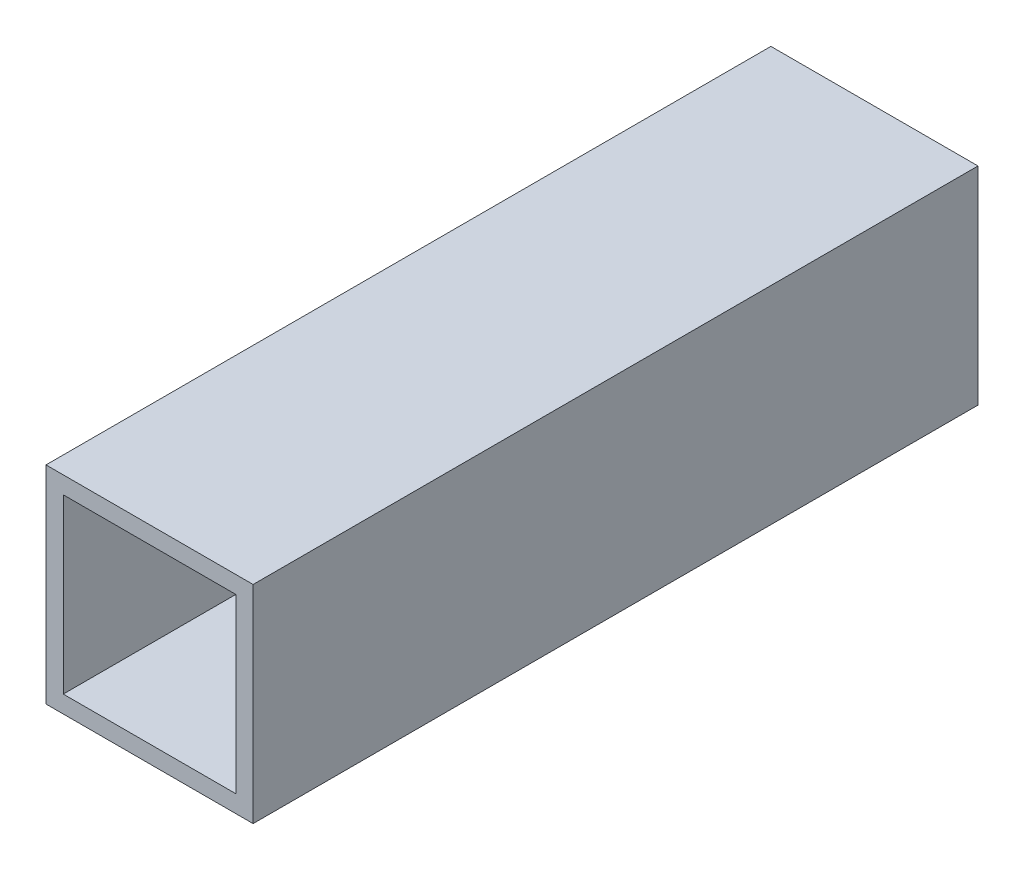
ISO-10303-21;
HEADER;
FILE_DESCRIPTION(('STEP AP214'),'2;1');
FILE_NAME('part.step','',(''),(''),'','','');
FILE_SCHEMA(('AUTOMOTIVE_DESIGN { 1 0 10303 214 1 1 1 1 }'));
ENDSEC;
DATA;
#1=APPLICATION_CONTEXT('core data for automotive mechanical design processes');
#2=APPLICATION_PROTOCOL_DEFINITION('international standard','automotive_design',2000,#1);
#3=PRODUCT_CONTEXT('',#1,'mechanical');
#4=PRODUCT('Part','Part','',(#3));
#5=PRODUCT_RELATED_PRODUCT_CATEGORY('part','',(#4));
#6=PRODUCT_DEFINITION_FORMATION('','',#4);
#7=PRODUCT_DEFINITION_CONTEXT('part definition',#1,'design');
#8=PRODUCT_DEFINITION('design','',#6,#7);
#9=PRODUCT_DEFINITION_SHAPE('','',#8);
#10=(LENGTH_UNIT() NAMED_UNIT(*) SI_UNIT(.MILLI.,.METRE.));
#11=(NAMED_UNIT(*) PLANE_ANGLE_UNIT() SI_UNIT($,.RADIAN.));
#12=(NAMED_UNIT(*) SI_UNIT($,.STERADIAN.) SOLID_ANGLE_UNIT());
#13=UNCERTAINTY_MEASURE_WITH_UNIT(LENGTH_MEASURE(1.E-05),#10,'distance_accuracy_value','');
#14=(GEOMETRIC_REPRESENTATION_CONTEXT(3) GLOBAL_UNCERTAINTY_ASSIGNED_CONTEXT((#13)) GLOBAL_UNIT_ASSIGNED_CONTEXT((#10,
#11,#12)) REPRESENTATION_CONTEXT('',''));
#15=CARTESIAN_POINT('',(0.,0.,0.));
#16=DIRECTION('',(0.,0.,1.));
#17=DIRECTION('',(1.,0.,0.));
#18=AXIS2_PLACEMENT_3D('',#15,#16,#17);
#19=CARTESIAN_POINT('',(-19.05,19.05,-66.675));
#20=DIRECTION('',(1.,0.,0.));
#21=DIRECTION('',(0.,0.,-1.));
#22=AXIS2_PLACEMENT_3D('',#19,#20,#21);
#23=PLANE('',#22);
#24=DIRECTION('',(0.,0.,1.));
#25=VECTOR('',#24,1.);
#26=CARTESIAN_POINT('',(-19.05,-19.05,-66.675));
#27=LINE('',#26,#25);
#28=CARTESIAN_POINT('',(-19.05,-19.05,-66.675));
#29=VERTEX_POINT('',#28);
#30=CARTESIAN_POINT('',(-19.05,-19.05,66.675));
#31=VERTEX_POINT('',#30);
#32=EDGE_CURVE('E129',#29,#31,#27,.T.);
#33=ORIENTED_EDGE('',*,*,#32,.T.);
#34=DIRECTION('',(0.,-1.,0.));
#35=VECTOR('',#34,1.);
#36=CARTESIAN_POINT('',(-19.05,19.05,66.675));
#37=LINE('',#36,#35);
#38=CARTESIAN_POINT('',(-19.05,19.05,66.675));
#39=VERTEX_POINT('',#38);
#40=EDGE_CURVE('E11',#39,#31,#37,.T.);
#41=ORIENTED_EDGE('',*,*,#40,.F.);
#42=DIRECTION('',(0.,0.,1.));
#43=VECTOR('',#42,1.);
#44=CARTESIAN_POINT('',(-19.05,19.05,-66.675));
#45=LINE('',#44,#43);
#46=CARTESIAN_POINT('',(-19.05,19.05,-66.675));
#47=VERTEX_POINT('',#46);
#48=EDGE_CURVE('E133',#47,#39,#45,.T.);
#49=ORIENTED_EDGE('',*,*,#48,.F.);
#50=DIRECTION('',(0.,-1.,0.));
#51=VECTOR('',#50,1.);
#52=CARTESIAN_POINT('',(-19.05,19.05,-66.675));
#53=LINE('',#52,#51);
#54=EDGE_CURVE('E143',#47,#29,#53,.T.);
#55=ORIENTED_EDGE('',*,*,#54,.T.);
#56=EDGE_LOOP('',(#33,#41,#49,#55));
#57=FACE_BOUND('',#56,.T.);
#58=ADVANCED_FACE('F32',(#57),#23,.F.);
#59=CARTESIAN_POINT('',(-19.05,19.05,66.675));
#60=DIRECTION('',(0.,0.,-1.));
#61=DIRECTION('',(-1.,0.,0.));
#62=AXIS2_PLACEMENT_3D('',#59,#60,#61);
#63=PLANE('',#62);
#64=DIRECTION('',(1.,0.,0.));
#65=VECTOR('',#64,1.);
#66=CARTESIAN_POINT('',(-15.875,-15.875,66.675));
#67=LINE('',#66,#65);
#68=CARTESIAN_POINT('',(-15.875,-15.875,66.675));
#69=VERTEX_POINT('',#68);
#70=CARTESIAN_POINT('',(15.875,-15.875,66.675));
#71=VERTEX_POINT('',#70);
#72=EDGE_CURVE('E123',#69,#71,#67,.T.);
#73=ORIENTED_EDGE('',*,*,#72,.F.);
#74=DIRECTION('',(0.,-1.,0.));
#75=VECTOR('',#74,1.);
#76=CARTESIAN_POINT('',(-15.875,15.875,66.675));
#77=LINE('',#76,#75);
#78=CARTESIAN_POINT('',(-15.875,15.875,66.675));
#79=VERTEX_POINT('',#78);
#80=EDGE_CURVE('E46',#79,#69,#77,.T.);
#81=ORIENTED_EDGE('',*,*,#80,.F.);
#82=DIRECTION('',(-1.,0.,0.));
#83=VECTOR('',#82,1.);
#84=CARTESIAN_POINT('',(-15.875,15.875,66.675));
#85=LINE('',#84,#83);
#86=CARTESIAN_POINT('',(15.875,15.875,66.675));
#87=VERTEX_POINT('',#86);
#88=EDGE_CURVE('E114',#87,#79,#85,.T.);
#89=ORIENTED_EDGE('',*,*,#88,.F.);
#90=DIRECTION('',(0.,1.,0.));
#91=VECTOR('',#90,1.);
#92=CARTESIAN_POINT('',(15.875,15.875,66.675));
#93=LINE('',#92,#91);
#94=EDGE_CURVE('E117',#71,#87,#93,.T.);
#95=ORIENTED_EDGE('',*,*,#94,.F.);
#96=EDGE_LOOP('',(#73,#81,#89,#95));
#97=FACE_BOUND('',#96,.T.);
#98=DIRECTION('',(1.,0.,0.));
#99=VECTOR('',#98,1.);
#100=CARTESIAN_POINT('',(-19.05,-19.05,66.675));
#101=LINE('',#100,#99);
#102=CARTESIAN_POINT('',(19.05,-19.05,66.675));
#103=VERTEX_POINT('',#102);
#104=EDGE_CURVE('E146',#31,#103,#101,.T.);
#105=ORIENTED_EDGE('',*,*,#104,.T.);
#106=DIRECTION('',(0.,-1.,0.));
#107=VECTOR('',#106,1.);
#108=CARTESIAN_POINT('',(19.05,19.05,66.675));
#109=LINE('',#108,#107);
#110=CARTESIAN_POINT('',(19.05,19.05,66.675));
#111=VERTEX_POINT('',#110);
#112=EDGE_CURVE('E39',#111,#103,#109,.T.);
#113=ORIENTED_EDGE('',*,*,#112,.F.);
#114=DIRECTION('',(1.,0.,0.));
#115=VECTOR('',#114,1.);
#116=CARTESIAN_POINT('',(-19.05,19.05,66.675));
#117=LINE('',#116,#115);
#118=EDGE_CURVE('E136',#39,#111,#117,.T.);
#119=ORIENTED_EDGE('',*,*,#118,.F.);
#120=ORIENTED_EDGE('',*,*,#40,.T.);
#121=EDGE_LOOP('',(#105,#113,#119,#120));
#122=FACE_BOUND('',#121,.T.);
#123=ADVANCED_FACE('F174',(#97,#122),#63,.F.);
#124=CARTESIAN_POINT('',(19.05,19.05,-66.675));
#125=DIRECTION('',(-1.,0.,0.));
#126=DIRECTION('',(0.,0.,1.));
#127=AXIS2_PLACEMENT_3D('',#124,#125,#126);
#128=PLANE('',#127);
#129=DIRECTION('',(0.,0.,-1.));
#130=VECTOR('',#129,1.);
#131=CARTESIAN_POINT('',(19.05,-19.05,-66.675));
#132=LINE('',#131,#130);
#133=CARTESIAN_POINT('',(19.05,-19.05,-66.675));
#134=VERTEX_POINT('',#133);
#135=EDGE_CURVE('E148',#103,#134,#132,.T.);
#136=ORIENTED_EDGE('',*,*,#135,.T.);
#137=DIRECTION('',(0.,-1.,0.));
#138=VECTOR('',#137,1.);
#139=CARTESIAN_POINT('',(19.05,19.05,-66.675));
#140=LINE('',#139,#138);
#141=CARTESIAN_POINT('',(19.05,19.05,-66.675));
#142=VERTEX_POINT('',#141);
#143=EDGE_CURVE('E153',#142,#134,#140,.T.);
#144=ORIENTED_EDGE('',*,*,#143,.F.);
#145=DIRECTION('',(0.,0.,-1.));
#146=VECTOR('',#145,1.);
#147=CARTESIAN_POINT('',(19.05,19.05,-66.675));
#148=LINE('',#147,#146);
#149=EDGE_CURVE('E139',#111,#142,#148,.T.);
#150=ORIENTED_EDGE('',*,*,#149,.F.);
#151=ORIENTED_EDGE('',*,*,#112,.T.);
#152=EDGE_LOOP('',(#136,#144,#150,#151));
#153=FACE_BOUND('',#152,.T.);
#154=ADVANCED_FACE('F160',(#153),#128,.F.);
#155=CARTESIAN_POINT('',(-19.05,19.05,-66.675));
#156=DIRECTION('',(0.,0.,1.));
#157=DIRECTION('',(1.,0.,0.));
#158=AXIS2_PLACEMENT_3D('',#155,#156,#157);
#159=PLANE('',#158);
#160=DIRECTION('',(-1.,0.,0.));
#161=VECTOR('',#160,1.);
#162=CARTESIAN_POINT('',(-15.875,15.875,-66.675));
#163=LINE('',#162,#161);
#164=CARTESIAN_POINT('',(15.875,15.875,-66.675));
#165=VERTEX_POINT('',#164);
#166=CARTESIAN_POINT('',(-15.875,15.875,-66.675));
#167=VERTEX_POINT('',#166);
#168=EDGE_CURVE('E104',#165,#167,#163,.T.);
#169=ORIENTED_EDGE('',*,*,#168,.T.);
#170=DIRECTION('',(0.,-1.,0.));
#171=VECTOR('',#170,1.);
#172=CARTESIAN_POINT('',(-15.875,15.875,-66.675));
#173=LINE('',#172,#171);
#174=CARTESIAN_POINT('',(-15.875,-15.875,-66.675));
#175=VERTEX_POINT('',#174);
#176=EDGE_CURVE('E98',#167,#175,#173,.T.);
#177=ORIENTED_EDGE('',*,*,#176,.T.);
#178=DIRECTION('',(1.,0.,0.));
#179=VECTOR('',#178,1.);
#180=CARTESIAN_POINT('',(-15.875,-15.875,-66.675));
#181=LINE('',#180,#179);
#182=CARTESIAN_POINT('',(15.875,-15.875,-66.675));
#183=VERTEX_POINT('',#182);
#184=EDGE_CURVE('E107',#175,#183,#181,.T.);
#185=ORIENTED_EDGE('',*,*,#184,.T.);
#186=DIRECTION('',(0.,1.,0.));
#187=VECTOR('',#186,1.);
#188=CARTESIAN_POINT('',(15.875,15.875,-66.675));
#189=LINE('',#188,#187);
#190=EDGE_CURVE('E54',#183,#165,#189,.T.);
#191=ORIENTED_EDGE('',*,*,#190,.T.);
#192=EDGE_LOOP('',(#169,#177,#185,#191));
#193=FACE_BOUND('',#192,.T.);
#194=DIRECTION('',(-1.,0.,0.));
#195=VECTOR('',#194,1.);
#196=CARTESIAN_POINT('',(-19.05,-19.05,-66.675));
#197=LINE('',#196,#195);
#198=EDGE_CURVE('E137',#134,#29,#197,.T.);
#199=ORIENTED_EDGE('',*,*,#198,.T.);
#200=ORIENTED_EDGE('',*,*,#54,.F.);
#201=DIRECTION('',(-1.,0.,0.));
#202=VECTOR('',#201,1.);
#203=CARTESIAN_POINT('',(-19.05,19.05,-66.675));
#204=LINE('',#203,#202);
#205=EDGE_CURVE('E141',#142,#47,#204,.T.);
#206=ORIENTED_EDGE('',*,*,#205,.F.);
#207=ORIENTED_EDGE('',*,*,#143,.T.);
#208=EDGE_LOOP('',(#199,#200,#206,#207));
#209=FACE_BOUND('',#208,.T.);
#210=ADVANCED_FACE('F111',(#193,#209),#159,.F.);
#211=CARTESIAN_POINT('',(0.,19.05,0.));
#212=DIRECTION('',(0.,1.,0.));
#213=DIRECTION('',(0.,0.,1.));
#214=AXIS2_PLACEMENT_3D('',#211,#212,#213);
#215=PLANE('',#214);
#216=ORIENTED_EDGE('',*,*,#48,.T.);
#217=ORIENTED_EDGE('',*,*,#118,.T.);
#218=ORIENTED_EDGE('',*,*,#149,.T.);
#219=ORIENTED_EDGE('',*,*,#205,.T.);
#220=EDGE_LOOP('',(#216,#217,#218,#219));
#221=FACE_BOUND('',#220,.T.);
#222=ADVANCED_FACE('F173',(#221),#215,.T.);
#223=CARTESIAN_POINT('',(0.,-19.05,0.));
#224=DIRECTION('',(0.,1.,0.));
#225=DIRECTION('',(0.,0.,1.));
#226=AXIS2_PLACEMENT_3D('',#223,#224,#225);
#227=PLANE('',#226);
#228=ORIENTED_EDGE('',*,*,#32,.F.);
#229=ORIENTED_EDGE('',*,*,#198,.F.);
#230=ORIENTED_EDGE('',*,*,#135,.F.);
#231=ORIENTED_EDGE('',*,*,#104,.F.);
#232=EDGE_LOOP('',(#228,#229,#230,#231));
#233=FACE_BOUND('',#232,.T.);
#234=ADVANCED_FACE('F166',(#233),#227,.F.);
#235=CARTESIAN_POINT('',(-15.875,15.875,-66.675));
#236=DIRECTION('',(-1.,0.,0.));
#237=DIRECTION('',(0.,-1.,0.));
#238=AXIS2_PLACEMENT_3D('',#235,#236,#237);
#239=PLANE('',#238);
#240=ORIENTED_EDGE('',*,*,#80,.T.);
#241=DIRECTION('',(0.,0.,1.));
#242=VECTOR('',#241,1.);
#243=CARTESIAN_POINT('',(-15.875,-15.875,-66.675));
#244=LINE('',#243,#242);
#245=EDGE_CURVE('E94',#175,#69,#244,.T.);
#246=ORIENTED_EDGE('',*,*,#245,.F.);
#247=ORIENTED_EDGE('',*,*,#176,.F.);
#248=DIRECTION('',(0.,0.,1.));
#249=VECTOR('',#248,1.);
#250=CARTESIAN_POINT('',(-15.875,15.875,-66.675));
#251=LINE('',#250,#249);
#252=EDGE_CURVE('E127',#167,#79,#251,.T.);
#253=ORIENTED_EDGE('',*,*,#252,.T.);
#254=EDGE_LOOP('',(#240,#246,#247,#253));
#255=FACE_BOUND('',#254,.T.);
#256=ADVANCED_FACE('F96',(#255),#239,.F.);
#257=CARTESIAN_POINT('',(-15.875,15.875,-66.675));
#258=DIRECTION('',(0.,1.,0.));
#259=DIRECTION('',(0.,0.,1.));
#260=AXIS2_PLACEMENT_3D('',#257,#258,#259);
#261=PLANE('',#260);
#262=ORIENTED_EDGE('',*,*,#88,.T.);
#263=ORIENTED_EDGE('',*,*,#252,.F.);
#264=ORIENTED_EDGE('',*,*,#168,.F.);
#265=DIRECTION('',(0.,0.,1.));
#266=VECTOR('',#265,1.);
#267=CARTESIAN_POINT('',(15.875,15.875,-66.675));
#268=LINE('',#267,#266);
#269=EDGE_CURVE('E130',#165,#87,#268,.T.);
#270=ORIENTED_EDGE('',*,*,#269,.T.);
#271=EDGE_LOOP('',(#262,#263,#264,#270));
#272=FACE_BOUND('',#271,.T.);
#273=ADVANCED_FACE('F191',(#272),#261,.F.);
#274=CARTESIAN_POINT('',(15.875,15.875,-66.675));
#275=DIRECTION('',(1.,0.,0.));
#276=DIRECTION('',(0.,1.,0.));
#277=AXIS2_PLACEMENT_3D('',#274,#275,#276);
#278=PLANE('',#277);
#279=ORIENTED_EDGE('',*,*,#94,.T.);
#280=ORIENTED_EDGE('',*,*,#269,.F.);
#281=ORIENTED_EDGE('',*,*,#190,.F.);
#282=DIRECTION('',(0.,0.,1.));
#283=VECTOR('',#282,1.);
#284=CARTESIAN_POINT('',(15.875,-15.875,-66.675));
#285=LINE('',#284,#283);
#286=EDGE_CURVE('E103',#183,#71,#285,.T.);
#287=ORIENTED_EDGE('',*,*,#286,.T.);
#288=EDGE_LOOP('',(#279,#280,#281,#287));
#289=FACE_BOUND('',#288,.T.);
#290=ADVANCED_FACE('F194',(#289),#278,.F.);
#291=CARTESIAN_POINT('',(-15.875,-15.875,-66.675));
#292=DIRECTION('',(0.,-1.,0.));
#293=DIRECTION('',(0.,0.,-1.));
#294=AXIS2_PLACEMENT_3D('',#291,#292,#293);
#295=PLANE('',#294);
#296=ORIENTED_EDGE('',*,*,#72,.T.);
#297=ORIENTED_EDGE('',*,*,#286,.F.);
#298=ORIENTED_EDGE('',*,*,#184,.F.);
#299=ORIENTED_EDGE('',*,*,#245,.T.);
#300=EDGE_LOOP('',(#296,#297,#298,#299));
#301=FACE_BOUND('',#300,.T.);
#302=ADVANCED_FACE('F108',(#301),#295,.F.);
#303=CLOSED_SHELL('',(#58,#123,#154,#210,#222,#234,#256,#273,#290,#302));
#304=MANIFOLD_SOLID_BREP('B2',#303);
#305=ADVANCED_BREP_SHAPE_REPRESENTATION('',(#18,#304),#14);
#306=SHAPE_DEFINITION_REPRESENTATION(#9,#305);
ENDSEC;
END-ISO-10303-21;
